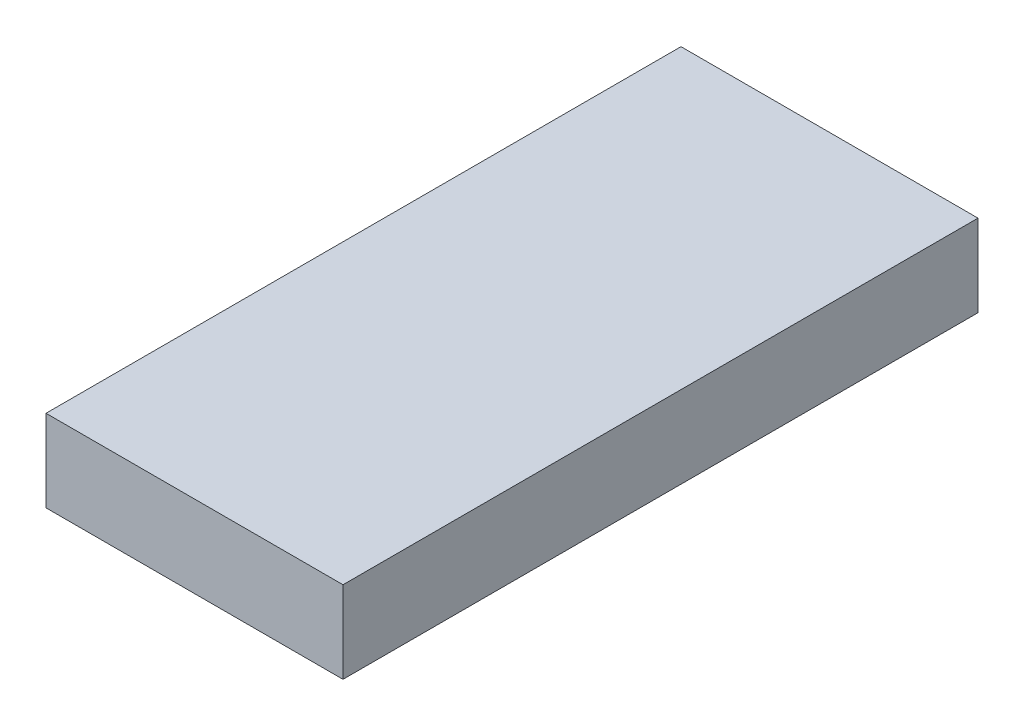
ISO-10303-21;
HEADER;
FILE_DESCRIPTION(('STEP AP214'),'2;1');
FILE_NAME('part.step','',(''),(''),'','','');
FILE_SCHEMA(('AUTOMOTIVE_DESIGN { 1 0 10303 214 1 1 1 1 }'));
ENDSEC;
DATA;
#1=APPLICATION_CONTEXT('core data for automotive mechanical design processes');
#2=APPLICATION_PROTOCOL_DEFINITION('international standard','automotive_design',2000,#1);
#3=PRODUCT_CONTEXT('',#1,'mechanical');
#4=PRODUCT('Part','Part','',(#3));
#5=PRODUCT_RELATED_PRODUCT_CATEGORY('part','',(#4));
#6=PRODUCT_DEFINITION_FORMATION('','',#4);
#7=PRODUCT_DEFINITION_CONTEXT('part definition',#1,'design');
#8=PRODUCT_DEFINITION('design','',#6,#7);
#9=PRODUCT_DEFINITION_SHAPE('','',#8);
#10=(LENGTH_UNIT() NAMED_UNIT(*) SI_UNIT(.MILLI.,.METRE.));
#11=(NAMED_UNIT(*) PLANE_ANGLE_UNIT() SI_UNIT($,.RADIAN.));
#12=(NAMED_UNIT(*) SI_UNIT($,.STERADIAN.) SOLID_ANGLE_UNIT());
#13=UNCERTAINTY_MEASURE_WITH_UNIT(LENGTH_MEASURE(1.E-05),#10,'distance_accuracy_value','');
#14=(GEOMETRIC_REPRESENTATION_CONTEXT(3) GLOBAL_UNCERTAINTY_ASSIGNED_CONTEXT((#13)) GLOBAL_UNIT_ASSIGNED_CONTEXT((#10,
#11,#12)) REPRESENTATION_CONTEXT('',''));
#15=CARTESIAN_POINT('',(0.,0.,0.));
#16=DIRECTION('',(0.,0.,1.));
#17=DIRECTION('',(1.,0.,0.));
#18=AXIS2_PLACEMENT_3D('',#15,#16,#17);
#19=CARTESIAN_POINT('',(0.,20.32,0.));
#20=DIRECTION('',(1.,0.,0.));
#21=DIRECTION('',(0.,0.,-1.));
#22=AXIS2_PLACEMENT_3D('',#19,#20,#21);
#23=PLANE('',#22);
#24=DIRECTION('',(0.,0.,1.));
#25=VECTOR('',#24,1.);
#26=CARTESIAN_POINT('',(0.,0.,0.));
#27=LINE('',#26,#25);
#28=CARTESIAN_POINT('',(0.,0.,-157.48));
#29=VERTEX_POINT('',#28);
#30=CARTESIAN_POINT('',(0.,0.,0.));
#31=VERTEX_POINT('',#30);
#32=EDGE_CURVE('E96',#29,#31,#27,.T.);
#33=ORIENTED_EDGE('',*,*,#32,.T.);
#34=DIRECTION('',(0.,-1.,0.));
#35=VECTOR('',#34,1.);
#36=CARTESIAN_POINT('',(0.,20.32,0.));
#37=LINE('',#36,#35);
#38=CARTESIAN_POINT('',(0.,20.32,0.));
#39=VERTEX_POINT('',#38);
#40=EDGE_CURVE('E11',#39,#31,#37,.T.);
#41=ORIENTED_EDGE('',*,*,#40,.F.);
#42=DIRECTION('',(0.,0.,1.));
#43=VECTOR('',#42,1.);
#44=CARTESIAN_POINT('',(0.,20.32,0.));
#45=LINE('',#44,#43);
#46=CARTESIAN_POINT('',(0.,20.32,-157.48));
#47=VERTEX_POINT('',#46);
#48=EDGE_CURVE('E84',#47,#39,#45,.T.);
#49=ORIENTED_EDGE('',*,*,#48,.F.);
#50=DIRECTION('',(0.,-1.,0.));
#51=VECTOR('',#50,1.);
#52=CARTESIAN_POINT('',(0.,20.32,-157.48));
#53=LINE('',#52,#51);
#54=EDGE_CURVE('E92',#47,#29,#53,.T.);
#55=ORIENTED_EDGE('',*,*,#54,.T.);
#56=EDGE_LOOP('',(#33,#41,#49,#55));
#57=FACE_BOUND('',#56,.T.);
#58=ADVANCED_FACE('F33',(#57),#23,.F.);
#59=CARTESIAN_POINT('',(0.,20.32,0.));
#60=DIRECTION('',(0.,0.,-1.));
#61=DIRECTION('',(-1.,0.,0.));
#62=AXIS2_PLACEMENT_3D('',#59,#60,#61);
#63=PLANE('',#62);
#64=DIRECTION('',(1.,0.,0.));
#65=VECTOR('',#64,1.);
#66=CARTESIAN_POINT('',(0.,0.,0.));
#67=LINE('',#66,#65);
#68=CARTESIAN_POINT('',(73.66,0.,0.));
#69=VERTEX_POINT('',#68);
#70=EDGE_CURVE('E88',#31,#69,#67,.T.);
#71=ORIENTED_EDGE('',*,*,#70,.T.);
#72=DIRECTION('',(0.,-1.,0.));
#73=VECTOR('',#72,1.);
#74=CARTESIAN_POINT('',(73.66,20.32,0.));
#75=LINE('',#74,#73);
#76=CARTESIAN_POINT('',(73.66,20.32,0.));
#77=VERTEX_POINT('',#76);
#78=EDGE_CURVE('E41',#77,#69,#75,.T.);
#79=ORIENTED_EDGE('',*,*,#78,.F.);
#80=DIRECTION('',(1.,0.,0.));
#81=VECTOR('',#80,1.);
#82=CARTESIAN_POINT('',(0.,20.32,0.));
#83=LINE('',#82,#81);
#84=EDGE_CURVE('E79',#39,#77,#83,.T.);
#85=ORIENTED_EDGE('',*,*,#84,.F.);
#86=ORIENTED_EDGE('',*,*,#40,.T.);
#87=EDGE_LOOP('',(#71,#79,#85,#86));
#88=FACE_BOUND('',#87,.T.);
#89=ADVANCED_FACE('F87',(#88),#63,.F.);
#90=CARTESIAN_POINT('',(73.66,20.32,0.));
#91=DIRECTION('',(-1.,0.,0.));
#92=DIRECTION('',(0.,0.,1.));
#93=AXIS2_PLACEMENT_3D('',#90,#91,#92);
#94=PLANE('',#93);
#95=DIRECTION('',(0.,0.,-1.));
#96=VECTOR('',#95,1.);
#97=CARTESIAN_POINT('',(73.66,0.,0.));
#98=LINE('',#97,#96);
#99=CARTESIAN_POINT('',(73.66,0.,-157.48));
#100=VERTEX_POINT('',#99);
#101=EDGE_CURVE('E66',#69,#100,#98,.T.);
#102=ORIENTED_EDGE('',*,*,#101,.T.);
#103=DIRECTION('',(0.,-1.,0.));
#104=VECTOR('',#103,1.);
#105=CARTESIAN_POINT('',(73.66,20.32,-157.48));
#106=LINE('',#105,#104);
#107=CARTESIAN_POINT('',(73.66,20.32,-157.48));
#108=VERTEX_POINT('',#107);
#109=EDGE_CURVE('E89',#108,#100,#106,.T.);
#110=ORIENTED_EDGE('',*,*,#109,.F.);
#111=DIRECTION('',(0.,0.,-1.));
#112=VECTOR('',#111,1.);
#113=CARTESIAN_POINT('',(73.66,20.32,0.));
#114=LINE('',#113,#112);
#115=EDGE_CURVE('E82',#77,#108,#114,.T.);
#116=ORIENTED_EDGE('',*,*,#115,.F.);
#117=ORIENTED_EDGE('',*,*,#78,.T.);
#118=EDGE_LOOP('',(#102,#110,#116,#117));
#119=FACE_BOUND('',#118,.T.);
#120=ADVANCED_FACE('F90',(#119),#94,.F.);
#121=CARTESIAN_POINT('',(0.,20.32,-157.48));
#122=DIRECTION('',(0.,0.,1.));
#123=DIRECTION('',(1.,0.,0.));
#124=AXIS2_PLACEMENT_3D('',#121,#122,#123);
#125=PLANE('',#124);
#126=DIRECTION('',(-1.,0.,0.));
#127=VECTOR('',#126,1.);
#128=CARTESIAN_POINT('',(0.,0.,-157.48));
#129=LINE('',#128,#127);
#130=EDGE_CURVE('E72',#100,#29,#129,.T.);
#131=ORIENTED_EDGE('',*,*,#130,.T.);
#132=ORIENTED_EDGE('',*,*,#54,.F.);
#133=DIRECTION('',(-1.,0.,0.));
#134=VECTOR('',#133,1.);
#135=CARTESIAN_POINT('',(0.,20.32,-157.48));
#136=LINE('',#135,#134);
#137=EDGE_CURVE('E49',#108,#47,#136,.T.);
#138=ORIENTED_EDGE('',*,*,#137,.F.);
#139=ORIENTED_EDGE('',*,*,#109,.T.);
#140=EDGE_LOOP('',(#131,#132,#138,#139));
#141=FACE_BOUND('',#140,.T.);
#142=ADVANCED_FACE('F103',(#141),#125,.F.);
#143=CARTESIAN_POINT('',(0.,20.32,0.));
#144=DIRECTION('',(0.,-1.,0.));
#145=DIRECTION('',(0.,0.,-1.));
#146=AXIS2_PLACEMENT_3D('',#143,#144,#145);
#147=PLANE('',#146);
#148=ORIENTED_EDGE('',*,*,#48,.T.);
#149=ORIENTED_EDGE('',*,*,#84,.T.);
#150=ORIENTED_EDGE('',*,*,#115,.T.);
#151=ORIENTED_EDGE('',*,*,#137,.T.);
#152=EDGE_LOOP('',(#148,#149,#150,#151));
#153=FACE_BOUND('',#152,.T.);
#154=ADVANCED_FACE('F80',(#153),#147,.F.);
#155=CARTESIAN_POINT('',(0.,0.,0.));
#156=DIRECTION('',(0.,-1.,0.));
#157=DIRECTION('',(0.,0.,-1.));
#158=AXIS2_PLACEMENT_3D('',#155,#156,#157);
#159=PLANE('',#158);
#160=ORIENTED_EDGE('',*,*,#32,.F.);
#161=ORIENTED_EDGE('',*,*,#130,.F.);
#162=ORIENTED_EDGE('',*,*,#101,.F.);
#163=ORIENTED_EDGE('',*,*,#70,.F.);
#164=EDGE_LOOP('',(#160,#161,#162,#163));
#165=FACE_BOUND('',#164,.T.);
#166=ADVANCED_FACE('F106',(#165),#159,.T.);
#167=CLOSED_SHELL('',(#58,#89,#120,#142,#154,#166));
#168=MANIFOLD_SOLID_BREP('B2',#167);
#169=ADVANCED_BREP_SHAPE_REPRESENTATION('',(#18,#168),#14);
#170=SHAPE_DEFINITION_REPRESENTATION(#9,#169);
ENDSEC;
END-ISO-10303-21;
